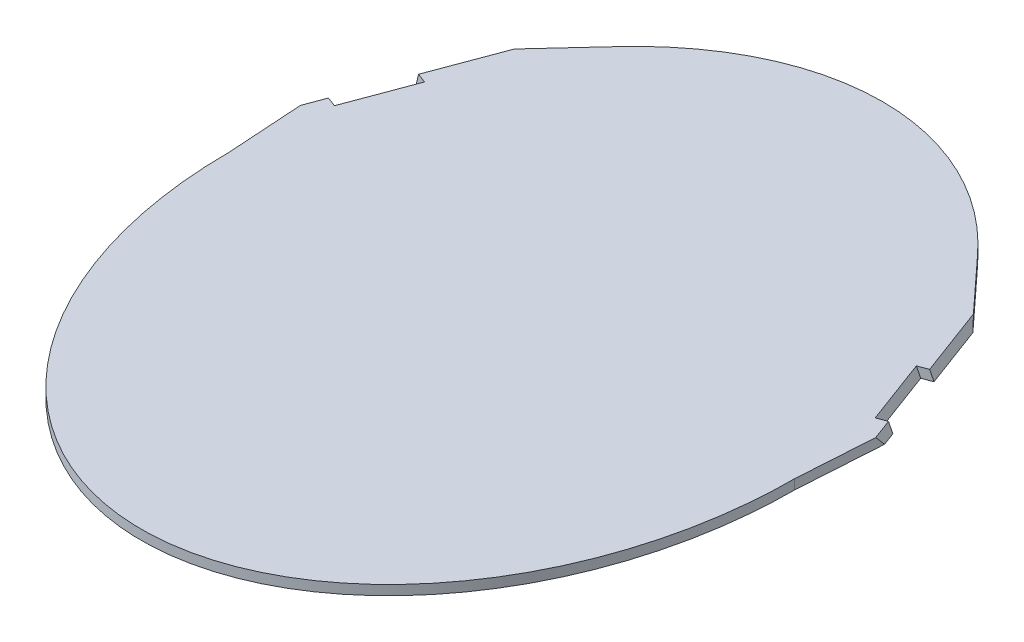
ISO-10303-21;
HEADER;
FILE_DESCRIPTION(('STEP AP214'),'2;1');
FILE_NAME('part.step','',(''),(''),'','','');
FILE_SCHEMA(('AUTOMOTIVE_DESIGN { 1 0 10303 214 1 1 1 1 }'));
ENDSEC;
DATA;
#1=APPLICATION_CONTEXT('core data for automotive mechanical design processes');
#2=APPLICATION_PROTOCOL_DEFINITION('international standard','automotive_design',2000,#1);
#3=PRODUCT_CONTEXT('',#1,'mechanical');
#4=PRODUCT('Part','Part','',(#3));
#5=PRODUCT_RELATED_PRODUCT_CATEGORY('part','',(#4));
#6=PRODUCT_DEFINITION_FORMATION('','',#4);
#7=PRODUCT_DEFINITION_CONTEXT('part definition',#1,'design');
#8=PRODUCT_DEFINITION('design','',#6,#7);
#9=PRODUCT_DEFINITION_SHAPE('','',#8);
#10=(LENGTH_UNIT() NAMED_UNIT(*) SI_UNIT(.MILLI.,.METRE.));
#11=(NAMED_UNIT(*) PLANE_ANGLE_UNIT() SI_UNIT($,.RADIAN.));
#12=(NAMED_UNIT(*) SI_UNIT($,.STERADIAN.) SOLID_ANGLE_UNIT());
#13=UNCERTAINTY_MEASURE_WITH_UNIT(LENGTH_MEASURE(1.E-05),#10,'distance_accuracy_value','');
#14=(GEOMETRIC_REPRESENTATION_CONTEXT(3) GLOBAL_UNCERTAINTY_ASSIGNED_CONTEXT((#13)) GLOBAL_UNIT_ASSIGNED_CONTEXT((#10,
#11,#12)) REPRESENTATION_CONTEXT('',''));
#15=CARTESIAN_POINT('',(0.,0.,0.));
#16=DIRECTION('',(0.,0.,1.));
#17=DIRECTION('',(1.,0.,0.));
#18=AXIS2_PLACEMENT_3D('',#15,#16,#17);
#19=CARTESIAN_POINT('',(0.,10.,0.));
#20=DIRECTION('',(0.,1.,0.));
#21=DIRECTION('',(0.,0.,1.));
#22=AXIS2_PLACEMENT_3D('',#19,#20,#21);
#23=PLANE('',#22);
#24=DIRECTION('',(-0.677985688036719,0.,0.735075102841456));
#25=VECTOR('',#24,1.);
#26=CARTESIAN_POINT('',(-244.797124662854,10.,-227.718261487219));
#27=LINE('',#26,#25);
#28=CARTESIAN_POINT('',(-188.989530621691,10.,-288.225103523861));
#29=VERTEX_POINT('',#28);
#30=CARTESIAN_POINT('',(-235.398823471506,10.,-237.907941500628));
#31=VERTEX_POINT('',#30);
#32=EDGE_CURVE('E179',#29,#31,#27,.T.);
#33=ORIENTED_EDGE('',*,*,#32,.T.);
#34=DIRECTION('',(-0.349563318607243,0.,0.936912742086632));
#35=VECTOR('',#34,1.);
#36=CARTESIAN_POINT('',(-284.551686512762,10.,-106.166590958256));
#37=LINE('',#36,#35);
#38=CARTESIAN_POINT('',(-262.120047496992,10.,-166.288712762963));
#39=VERTEX_POINT('',#38);
#40=EDGE_CURVE('E58',#31,#39,#37,.T.);
#41=ORIENTED_EDGE('',*,*,#40,.T.);
#42=DIRECTION('',(0.93691274208663,0.,0.349563318607247));
#43=VECTOR('',#42,1.);
#44=CARTESIAN_POINT('',(-262.120047496992,10.,-166.288712762963));
#45=LINE('',#44,#43);
#46=CARTESIAN_POINT('',(-252.194985780218,10.,-162.585659794155));
#47=VERTEX_POINT('',#46);
#48=EDGE_CURVE('E183',#39,#47,#45,.T.);
#49=ORIENTED_EDGE('',*,*,#48,.T.);
#50=DIRECTION('',(0.349563318607244,0.,-0.936912742086631));
#51=VECTOR('',#50,1.);
#52=CARTESIAN_POINT('',(-274.626624795988,10.,-102.463537989448));
#53=LINE('',#52,#51);
#54=CARTESIAN_POINT('',(-277.302971101002,10.,-95.290294053572));
#55=VERTEX_POINT('',#54);
#56=EDGE_CURVE('E314',#55,#47,#53,.T.);
#57=ORIENTED_EDGE('',*,*,#56,.F.);
#58=DIRECTION('',(-0.936912742086631,0.,-0.349563318607244));
#59=VECTOR('',#58,1.);
#60=CARTESIAN_POINT('',(-287.228032817776,10.,-98.9933470223794));
#61=LINE('',#60,#59);
#62=CARTESIAN_POINT('',(-287.228032817776,10.,-98.9933470223794));
#63=VERTEX_POINT('',#62);
#64=EDGE_CURVE('E191',#55,#63,#61,.T.);
#65=ORIENTED_EDGE('',*,*,#64,.T.);
#66=CARTESIAN_POINT('',(-295.026682691708,10.,-78.0911125800736));
#67=VERTEX_POINT('',#66);
#68=EDGE_CURVE('E282',#63,#67,#37,.T.);
#69=ORIENTED_EDGE('',*,*,#68,.T.);
#70=DIRECTION('',(0.0642365171820704,0.,0.997934702202663));
#71=VECTOR('',#70,1.);
#72=CARTESIAN_POINT('',(-296.597160238643,10.,-102.488980208452));
#73=LINE('',#72,#71);
#74=CARTESIAN_POINT('',(-290.,10.,0.));
#75=VERTEX_POINT('',#74);
#76=EDGE_CURVE('E177',#67,#75,#73,.T.);
#77=ORIENTED_EDGE('',*,*,#76,.T.);
#78=CARTESIAN_POINT('',(0.,10.,0.));
#79=DIRECTION('',(0.,1.,0.));
#80=DIRECTION('',(0.,0.,-1.));
#81=AXIS2_PLACEMENT_3D('',#78,#79,#80);
#82=ELLIPSE('',#81,380.,290.);
#83=CARTESIAN_POINT('',(290.,10.,2.4769174145734E-13));
#84=VERTEX_POINT('',#83);
#85=EDGE_CURVE('E231',#75,#84,#82,.T.);
#86=ORIENTED_EDGE('',*,*,#85,.T.);
#87=DIRECTION('',(0.0642365171820704,0.,-0.997934702202663));
#88=VECTOR('',#87,1.);
#89=CARTESIAN_POINT('',(296.597160238643,10.,-102.488980208452));
#90=LINE('',#89,#88);
#91=CARTESIAN_POINT('',(295.026682691708,10.,-78.0911125800736));
#92=VERTEX_POINT('',#91);
#93=EDGE_CURVE('E219',#84,#92,#90,.T.);
#94=ORIENTED_EDGE('',*,*,#93,.T.);
#95=DIRECTION('',(-0.349563318607243,0.,-0.936912742086632));
#96=VECTOR('',#95,1.);
#97=CARTESIAN_POINT('',(284.551686512762,10.,-106.166590958256));
#98=LINE('',#97,#96);
#99=CARTESIAN_POINT('',(287.228032817776,10.,-98.9933470223794));
#100=VERTEX_POINT('',#99);
#101=EDGE_CURVE('E267',#92,#100,#98,.T.);
#102=ORIENTED_EDGE('',*,*,#101,.T.);
#103=DIRECTION('',(-0.936912742086631,0.,0.349563318607244));
#104=VECTOR('',#103,1.);
#105=CARTESIAN_POINT('',(287.228032817776,10.,-98.9933470223794));
#106=LINE('',#105,#104);
#107=CARTESIAN_POINT('',(277.302971101002,10.,-95.290294053572));
#108=VERTEX_POINT('',#107);
#109=EDGE_CURVE('E215',#100,#108,#106,.T.);
#110=ORIENTED_EDGE('',*,*,#109,.T.);
#111=DIRECTION('',(0.349563318607244,0.,0.936912742086631));
#112=VECTOR('',#111,1.);
#113=CARTESIAN_POINT('',(274.626624795988,10.,-102.463537989448));
#114=LINE('',#113,#112);
#115=CARTESIAN_POINT('',(252.194985780218,10.,-162.585659794155));
#116=VERTEX_POINT('',#115);
#117=EDGE_CURVE('E185',#116,#108,#114,.T.);
#118=ORIENTED_EDGE('',*,*,#117,.F.);
#119=DIRECTION('',(0.936912742086631,0.,-0.349563318607243));
#120=VECTOR('',#119,1.);
#121=CARTESIAN_POINT('',(262.120047496992,10.,-166.288712762963));
#122=LINE('',#121,#120);
#123=CARTESIAN_POINT('',(262.120047496992,10.,-166.288712762963));
#124=VERTEX_POINT('',#123);
#125=EDGE_CURVE('E206',#116,#124,#122,.T.);
#126=ORIENTED_EDGE('',*,*,#125,.T.);
#127=CARTESIAN_POINT('',(235.398823471506,10.,-237.907941500628));
#128=VERTEX_POINT('',#127);
#129=EDGE_CURVE('E274',#124,#128,#98,.T.);
#130=ORIENTED_EDGE('',*,*,#129,.T.);
#131=DIRECTION('',(-0.677985688036719,0.,-0.735075102841456));
#132=VECTOR('',#131,1.);
#133=CARTESIAN_POINT('',(244.797124662854,10.,-227.718261487219));
#134=LINE('',#133,#132);
#135=CARTESIAN_POINT('',(188.989530621691,10.,-288.225103523861));
#136=VERTEX_POINT('',#135);
#137=EDGE_CURVE('E202',#128,#136,#134,.T.);
#138=ORIENTED_EDGE('',*,*,#137,.T.);
#139=EDGE_CURVE('E234',#136,#29,#82,.T.);
#140=ORIENTED_EDGE('',*,*,#139,.T.);
#141=EDGE_LOOP('',(#33,#41,#49,#57,#65,#69,#77,#86,#94,#102,#110,#118,#126,#130,#138,#140));
#142=FACE_BOUND('',#141,.T.);
#143=ADVANCED_FACE('F33',(#142),#23,.T.);
#144=CARTESIAN_POINT('',(0.,0.,0.));
#145=DIRECTION('',(0.,1.,0.));
#146=DIRECTION('',(0.,0.,1.));
#147=AXIS2_PLACEMENT_3D('',#144,#145,#146);
#148=PLANE('',#147);
#149=DIRECTION('',(-0.349563318607243,0.,0.936912742086632));
#150=VECTOR('',#149,1.);
#151=CARTESIAN_POINT('',(-287.826789786454,0.,-107.388536095413));
#152=LINE('',#151,#150);
#153=CARTESIAN_POINT('',(-241.664357599071,0.,-231.114821491688));
#154=VERTEX_POINT('',#153);
#155=CARTESIAN_POINT('',(-265.395150770684,0.,-167.51065790012));
#156=VERTEX_POINT('',#155);
#157=EDGE_CURVE('E158',#154,#156,#152,.T.);
#158=ORIENTED_EDGE('',*,*,#157,.F.);
#159=DIRECTION('',(-0.677985688036719,0.,0.735075102841456));
#160=VECTOR('',#159,1.);
#161=CARTESIAN_POINT('',(-244.797124662854,0.,-227.718261487219));
#162=LINE('',#161,#160);
#163=CARTESIAN_POINT('',(-188.989530621691,0.,-288.225103523861));
#164=VERTEX_POINT('',#163);
#165=EDGE_CURVE('E168',#164,#154,#162,.T.);
#166=ORIENTED_EDGE('',*,*,#165,.F.);
#167=CARTESIAN_POINT('',(0.,0.,0.));
#168=DIRECTION('',(0.,1.,0.));
#169=DIRECTION('',(0.,0.,-1.));
#170=AXIS2_PLACEMENT_3D('',#167,#168,#169);
#171=ELLIPSE('',#170,380.,290.);
#172=CARTESIAN_POINT('',(188.989530621691,0.,-288.225103523861));
#173=VERTEX_POINT('',#172);
#174=EDGE_CURVE('E237',#173,#164,#171,.T.);
#175=ORIENTED_EDGE('',*,*,#174,.F.);
#176=DIRECTION('',(-0.677985688036719,0.,-0.735075102841456));
#177=VECTOR('',#176,1.);
#178=CARTESIAN_POINT('',(244.797124662854,0.,-227.718261487219));
#179=LINE('',#178,#177);
#180=CARTESIAN_POINT('',(241.664357599071,0.,-231.114821491688));
#181=VERTEX_POINT('',#180);
#182=EDGE_CURVE('E203',#181,#173,#179,.T.);
#183=ORIENTED_EDGE('',*,*,#182,.F.);
#184=DIRECTION('',(-0.349563318607243,0.,-0.936912742086632));
#185=VECTOR('',#184,1.);
#186=CARTESIAN_POINT('',(287.826789786454,0.,-107.388536095413));
#187=LINE('',#186,#185);
#188=CARTESIAN_POINT('',(265.395150770684,0.,-167.51065790012));
#189=VERTEX_POINT('',#188);
#190=EDGE_CURVE('E270',#189,#181,#187,.T.);
#191=ORIENTED_EDGE('',*,*,#190,.F.);
#192=DIRECTION('',(0.93691274208663,0.,-0.349563318607247));
#193=VECTOR('',#192,1.);
#194=CARTESIAN_POINT('',(262.120047496992,0.,-166.288712762963));
#195=LINE('',#194,#193);
#196=CARTESIAN_POINT('',(255.47008905391,0.,-163.807604931312));
#197=VERTEX_POINT('',#196);
#198=EDGE_CURVE('E205',#197,#189,#195,.T.);
#199=ORIENTED_EDGE('',*,*,#198,.F.);
#200=DIRECTION('',(0.349563318607244,0.,0.936912742086631));
#201=VECTOR('',#200,1.);
#202=CARTESIAN_POINT('',(277.90172806968,0.,-103.685483126605));
#203=LINE('',#202,#201);
#204=CARTESIAN_POINT('',(280.388867724071,0.,-97.0193579655542));
#205=VERTEX_POINT('',#204);
#206=EDGE_CURVE('E336',#197,#205,#203,.T.);
#207=ORIENTED_EDGE('',*,*,#206,.T.);
#208=CARTESIAN_POINT('',(280.496850606306,0.,-96.4819345009197));
#209=VERTEX_POINT('',#208);
#210=EDGE_CURVE('E235',#209,#205,#171,.T.);
#211=ORIENTED_EDGE('',*,*,#210,.F.);
#212=DIRECTION('',(-0.936912742086631,0.,0.349563318607244));
#213=VECTOR('',#212,1.);
#214=CARTESIAN_POINT('',(287.228032817776,0.,-98.9933470223794));
#215=LINE('',#214,#213);
#216=CARTESIAN_POINT('',(290.503136091468,0.,-100.215292159536));
#217=VERTEX_POINT('',#216);
#218=EDGE_CURVE('E216',#217,#209,#215,.T.);
#219=ORIENTED_EDGE('',*,*,#218,.F.);
#220=CARTESIAN_POINT('',(295.575664034813,0.,-86.6197121551897));
#221=VERTEX_POINT('',#220);
#222=EDGE_CURVE('E263',#221,#217,#187,.T.);
#223=ORIENTED_EDGE('',*,*,#222,.F.);
#224=DIRECTION('',(0.0642365171820704,0.,-0.997934702202663));
#225=VECTOR('',#224,1.);
#226=CARTESIAN_POINT('',(296.597160238643,0.,-102.488980208452));
#227=LINE('',#226,#225);
#228=CARTESIAN_POINT('',(290.,0.,2.4769174145734E-13));
#229=VERTEX_POINT('',#228);
#230=EDGE_CURVE('E218',#229,#221,#227,.T.);
#231=ORIENTED_EDGE('',*,*,#230,.F.);
#232=CARTESIAN_POINT('',(-290.,0.,2.4769174145734E-13));
#233=VERTEX_POINT('',#232);
#234=EDGE_CURVE('E230',#233,#229,#171,.T.);
#235=ORIENTED_EDGE('',*,*,#234,.F.);
#236=DIRECTION('',(0.0642365171820704,0.,0.997934702202663));
#237=VECTOR('',#236,1.);
#238=CARTESIAN_POINT('',(-296.597160238643,0.,-102.488980208452));
#239=LINE('',#238,#237);
#240=CARTESIAN_POINT('',(-295.575664034813,0.,-86.6197121551897));
#241=VERTEX_POINT('',#240);
#242=EDGE_CURVE('E190',#241,#233,#239,.T.);
#243=ORIENTED_EDGE('',*,*,#242,.F.);
#244=CARTESIAN_POINT('',(-290.503136091468,0.,-100.215292159536));
#245=VERTEX_POINT('',#244);
#246=EDGE_CURVE('E50',#245,#241,#152,.T.);
#247=ORIENTED_EDGE('',*,*,#246,.F.);
#248=DIRECTION('',(-0.936912742086631,0.,-0.349563318607244));
#249=VECTOR('',#248,1.);
#250=CARTESIAN_POINT('',(-287.228032817776,0.,-98.9933470223794));
#251=LINE('',#250,#249);
#252=CARTESIAN_POINT('',(-280.496850606306,0.,-96.4819345009197));
#253=VERTEX_POINT('',#252);
#254=EDGE_CURVE('E187',#253,#245,#251,.T.);
#255=ORIENTED_EDGE('',*,*,#254,.F.);
#256=CARTESIAN_POINT('',(-280.388867724071,0.,-97.0193579655542));
#257=VERTEX_POINT('',#256);
#258=EDGE_CURVE('E238',#257,#253,#171,.T.);
#259=ORIENTED_EDGE('',*,*,#258,.F.);
#260=DIRECTION('',(0.349563318607244,0.,-0.936912742086631));
#261=VECTOR('',#260,1.);
#262=CARTESIAN_POINT('',(-277.90172806968,0.,-103.685483126605));
#263=LINE('',#262,#261);
#264=CARTESIAN_POINT('',(-255.47008905391,0.,-163.807604931312));
#265=VERTEX_POINT('',#264);
#266=EDGE_CURVE('E299',#257,#265,#263,.T.);
#267=ORIENTED_EDGE('',*,*,#266,.T.);
#268=DIRECTION('',(0.936912742086631,0.,0.349563318607243));
#269=VECTOR('',#268,1.);
#270=CARTESIAN_POINT('',(-262.120047496992,0.,-166.288712762963));
#271=LINE('',#270,#269);
#272=EDGE_CURVE('E171',#156,#265,#271,.T.);
#273=ORIENTED_EDGE('',*,*,#272,.F.);
#274=EDGE_LOOP('',(#158,#166,#175,#183,#191,#199,#207,#211,#219,#223,#231,#235,#243,#247,#255,
#259,#267,#273));
#275=FACE_BOUND('',#274,.T.);
#276=ADVANCED_FACE('F166',(#275),#148,.F.);
#277=CARTESIAN_POINT('',(-287.228032817776,0.,-98.9933470223794));
#278=DIRECTION('',(0.349563318607244,0.,-0.936912742086631));
#279=DIRECTION('',(-0.936912742086631,0.,-0.349563318607244));
#280=AXIS2_PLACEMENT_3D('',#277,#278,#279);
#281=PLANE('',#280);
#282=ORIENTED_EDGE('',*,*,#254,.T.);
#283=DIRECTION('',(0.309165431544454,0.943986817233752,0.11535001008592));
#284=VECTOR('',#283,1.);
#285=CARTESIAN_POINT('',(-290.146513735,1.08888888888885,-100.082235911268));
#286=LINE('',#285,#284);
#287=EDGE_CURVE('E278',#245,#63,#286,.T.);
#288=ORIENTED_EDGE('',*,*,#287,.T.);
#289=ORIENTED_EDGE('',*,*,#64,.F.);
#290=DIRECTION('',(-0.309165431544454,-0.943986817233752,-0.115350010085923));
#291=VECTOR('',#290,1.);
#292=CARTESIAN_POINT('',(-281.302180960719,-2.2109427566487,-96.7824042657311));
#293=LINE('',#292,#291);
#294=CARTESIAN_POINT('',(-280.496850606306,0.248003685991113,-96.4819345009197));
#295=VERTEX_POINT('',#294);
#296=EDGE_CURVE('E300',#55,#295,#293,.T.);
#297=ORIENTED_EDGE('',*,*,#296,.T.);
#298=DIRECTION('',(0.,-1.,0.));
#299=VECTOR('',#298,1.);
#300=CARTESIAN_POINT('',(-280.496850606306,10.,-96.4819345009197));
#301=LINE('',#300,#299);
#302=EDGE_CURVE('E199',#253,#295,#301,.F.);
#303=ORIENTED_EDGE('',*,*,#302,.F.);
#304=EDGE_LOOP('',(#282,#288,#289,#297,#303));
#305=FACE_BOUND('',#304,.T.);
#306=ADVANCED_FACE('F353',(#305),#281,.T.);
#307=CARTESIAN_POINT('',(-296.597160238643,0.,-102.488980208452));
#308=DIRECTION('',(-0.997934702202663,0.,0.0642365171820704));
#309=DIRECTION('',(0.0642365171820704,0.,0.997934702202663));
#310=AXIS2_PLACEMENT_3D('',#307,#308,#309);
#311=PLANE('',#310);
#312=ORIENTED_EDGE('',*,*,#76,.F.);
#313=DIRECTION('',(-0.0417336482239318,-0.760201576030195,-0.648345483833372));
#314=VECTOR('',#313,1.);
#315=CARTESIAN_POINT('',(-296.006831007897,-7.8539458307572,-93.3180280627078));
#316=LINE('',#315,#314);
#317=EDGE_CURVE('E287',#67,#241,#316,.T.);
#318=ORIENTED_EDGE('',*,*,#317,.T.);
#319=ORIENTED_EDGE('',*,*,#242,.T.);
#320=DIRECTION('',(0.,1.,0.));
#321=VECTOR('',#320,1.);
#322=CARTESIAN_POINT('',(-290.,0.,2.4769174145734E-13));
#323=LINE('',#322,#321);
#324=EDGE_CURVE('E193',#233,#75,#323,.T.);
#325=ORIENTED_EDGE('',*,*,#324,.T.);
#326=EDGE_LOOP('',(#312,#318,#319,#325));
#327=FACE_BOUND('',#326,.T.);
#328=ADVANCED_FACE('F360',(#327),#311,.T.);
#329=CARTESIAN_POINT('',(-262.120047496992,0.,-166.288712762963));
#330=DIRECTION('',(-0.349563318607247,0.,0.93691274208663));
#331=DIRECTION('',(0.93691274208663,0.,0.349563318607247));
#332=AXIS2_PLACEMENT_3D('',#329,#330,#331);
#333=PLANE('',#332);
#334=ORIENTED_EDGE('',*,*,#48,.F.);
#335=DIRECTION('',(-0.309165431544453,-0.943986817233752,-0.115350010085921));
#336=VECTOR('',#335,1.);
#337=CARTESIAN_POINT('',(-265.038528414216,1.08888888888884,-167.377601651852));
#338=LINE('',#337,#336);
#339=EDGE_CURVE('E289',#39,#156,#338,.T.);
#340=ORIENTED_EDGE('',*,*,#339,.T.);
#341=ORIENTED_EDGE('',*,*,#272,.T.);
#342=DIRECTION('',(0.309165431544453,0.943986817233752,0.115350010085924));
#343=VECTOR('',#342,1.);
#344=CARTESIAN_POINT('',(-246.896185956159,26.179031258715,-160.608670937105));
#345=LINE('',#344,#343);
#346=EDGE_CURVE('E297',#265,#47,#345,.T.);
#347=ORIENTED_EDGE('',*,*,#346,.T.);
#348=EDGE_LOOP('',(#334,#340,#341,#347));
#349=FACE_BOUND('',#348,.T.);
#350=ADVANCED_FACE('F295',(#349),#333,.T.);
#351=CARTESIAN_POINT('',(-244.797124662854,0.,-227.718261487219));
#352=DIRECTION('',(-0.735075102841456,0.,-0.677985688036719));
#353=DIRECTION('',(-0.677985688036719,0.,0.735075102841456));
#354=AXIS2_PLACEMENT_3D('',#351,#352,#353);
#355=PLANE('',#354);
#356=ORIENTED_EDGE('',*,*,#165,.T.);
#357=DIRECTION('',(0.460149819383471,0.734414353213777,-0.498896483766872));
#358=VECTOR('',#357,1.);
#359=CARTESIAN_POINT('',(-243.107421502934,-2.30317778896802,-229.55024517945));
#360=LINE('',#359,#358);
#361=EDGE_CURVE('E11',#154,#31,#360,.T.);
#362=ORIENTED_EDGE('',*,*,#361,.T.);
#363=ORIENTED_EDGE('',*,*,#32,.F.);
#364=DIRECTION('',(0.,1.,0.));
#365=VECTOR('',#364,1.);
#366=CARTESIAN_POINT('',(-188.989530621691,0.,-288.225103523861));
#367=LINE('',#366,#365);
#368=EDGE_CURVE('E175',#164,#29,#367,.T.);
#369=ORIENTED_EDGE('',*,*,#368,.F.);
#370=EDGE_LOOP('',(#356,#362,#363,#369));
#371=FACE_BOUND('',#370,.T.);
#372=ADVANCED_FACE('F173',(#371),#355,.T.);
#373=CARTESIAN_POINT('',(287.228032817776,0.,-98.9933470223794));
#374=DIRECTION('',(-0.349563318607244,0.,-0.936912742086631));
#375=DIRECTION('',(-0.936912742086631,0.,0.349563318607244));
#376=AXIS2_PLACEMENT_3D('',#373,#374,#375);
#377=PLANE('',#376);
#378=ORIENTED_EDGE('',*,*,#109,.F.);
#379=DIRECTION('',(0.309165431544454,-0.943986817233752,-0.11535001008592));
#380=VECTOR('',#379,1.);
#381=CARTESIAN_POINT('',(290.146513735,1.08888888888885,-100.082235911268));
#382=LINE('',#381,#380);
#383=EDGE_CURVE('E272',#100,#217,#382,.T.);
#384=ORIENTED_EDGE('',*,*,#383,.T.);
#385=ORIENTED_EDGE('',*,*,#218,.T.);
#386=DIRECTION('',(0.,-1.,0.));
#387=VECTOR('',#386,1.);
#388=CARTESIAN_POINT('',(280.496850606306,10.,-96.4819345009197));
#389=LINE('',#388,#387);
#390=CARTESIAN_POINT('',(280.496850606306,0.248003685991113,-96.4819345009197));
#391=VERTEX_POINT('',#390);
#392=EDGE_CURVE('E228',#391,#209,#389,.T.);
#393=ORIENTED_EDGE('',*,*,#392,.F.);
#394=DIRECTION('',(0.309165431544454,-0.943986817233752,-0.115350010085923));
#395=VECTOR('',#394,1.);
#396=CARTESIAN_POINT('',(281.302180960719,-2.2109427566487,-96.7824042657311));
#397=LINE('',#396,#395);
#398=EDGE_CURVE('E342',#108,#391,#397,.T.);
#399=ORIENTED_EDGE('',*,*,#398,.F.);
#400=EDGE_LOOP('',(#378,#384,#385,#393,#399));
#401=FACE_BOUND('',#400,.T.);
#402=ADVANCED_FACE('F349',(#401),#377,.T.);
#403=CARTESIAN_POINT('',(296.597160238643,0.,-102.488980208452));
#404=DIRECTION('',(0.997934702202663,0.,0.0642365171820704));
#405=DIRECTION('',(0.0642365171820704,0.,-0.997934702202663));
#406=AXIS2_PLACEMENT_3D('',#403,#404,#405);
#407=PLANE('',#406);
#408=ORIENTED_EDGE('',*,*,#230,.T.);
#409=DIRECTION('',(-0.0417336482239318,0.760201576030195,0.648345483833372));
#410=VECTOR('',#409,1.);
#411=CARTESIAN_POINT('',(296.006831007897,-7.8539458307572,-93.3180280627078));
#412=LINE('',#411,#410);
#413=EDGE_CURVE('E268',#221,#92,#412,.T.);
#414=ORIENTED_EDGE('',*,*,#413,.T.);
#415=ORIENTED_EDGE('',*,*,#93,.F.);
#416=DIRECTION('',(0.,1.,0.));
#417=VECTOR('',#416,1.);
#418=CARTESIAN_POINT('',(290.,0.,2.4769174145734E-13));
#419=LINE('',#418,#417);
#420=EDGE_CURVE('E222',#229,#84,#419,.T.);
#421=ORIENTED_EDGE('',*,*,#420,.F.);
#422=EDGE_LOOP('',(#408,#414,#415,#421));
#423=FACE_BOUND('',#422,.T.);
#424=ADVANCED_FACE('F259',(#423),#407,.T.);
#425=CARTESIAN_POINT('',(262.120047496992,0.,-166.288712762963));
#426=DIRECTION('',(0.349563318607243,0.,0.936912742086632));
#427=DIRECTION('',(0.936912742086632,0.,-0.349563318607243));
#428=AXIS2_PLACEMENT_3D('',#425,#426,#427);
#429=PLANE('',#428);
#430=ORIENTED_EDGE('',*,*,#198,.T.);
#431=DIRECTION('',(-0.309165431544454,0.943986817233752,0.11535001008592));
#432=VECTOR('',#431,1.);
#433=CARTESIAN_POINT('',(265.038528414216,1.08888888888884,-167.377601651852));
#434=LINE('',#433,#432);
#435=EDGE_CURVE('E275',#189,#124,#434,.T.);
#436=ORIENTED_EDGE('',*,*,#435,.T.);
#437=ORIENTED_EDGE('',*,*,#125,.F.);
#438=DIRECTION('',(-0.309165431544455,0.943986817233751,0.115350010085923));
#439=VECTOR('',#438,1.);
#440=CARTESIAN_POINT('',(253.145519393204,7.09769880961953,-162.94030507677));
#441=LINE('',#440,#439);
#442=EDGE_CURVE('E345',#197,#116,#441,.T.);
#443=ORIENTED_EDGE('',*,*,#442,.F.);
#444=EDGE_LOOP('',(#430,#436,#437,#443));
#445=FACE_BOUND('',#444,.T.);
#446=ADVANCED_FACE('F378',(#445),#429,.T.);
#447=CARTESIAN_POINT('',(244.797124662854,0.,-227.718261487219));
#448=DIRECTION('',(0.735075102841456,0.,-0.677985688036719));
#449=DIRECTION('',(-0.677985688036719,0.,-0.735075102841456));
#450=AXIS2_PLACEMENT_3D('',#447,#448,#449);
#451=PLANE('',#450);
#452=ORIENTED_EDGE('',*,*,#137,.F.);
#453=DIRECTION('',(0.460149819383471,-0.734414353213777,0.498896483766872));
#454=VECTOR('',#453,1.);
#455=CARTESIAN_POINT('',(243.107421502934,-2.30317778896802,-229.55024517945));
#456=LINE('',#455,#454);
#457=EDGE_CURVE('E43',#128,#181,#456,.T.);
#458=ORIENTED_EDGE('',*,*,#457,.T.);
#459=ORIENTED_EDGE('',*,*,#182,.T.);
#460=DIRECTION('',(0.,1.,0.));
#461=VECTOR('',#460,1.);
#462=CARTESIAN_POINT('',(188.989530621691,0.,-288.225103523861));
#463=LINE('',#462,#461);
#464=EDGE_CURVE('E209',#173,#136,#463,.T.);
#465=ORIENTED_EDGE('',*,*,#464,.T.);
#466=EDGE_LOOP('',(#452,#458,#459,#465));
#467=FACE_BOUND('',#466,.T.);
#468=ADVANCED_FACE('F379',(#467),#451,.T.);
#469=DIRECTION('',(0.,-1.,0.));
#470=VECTOR('',#469,1.);
#471=SURFACE_OF_LINEAR_EXTRUSION('',#82,#470);
#472=ORIENTED_EDGE('',*,*,#174,.T.);
#473=ORIENTED_EDGE('',*,*,#368,.T.);
#474=ORIENTED_EDGE('',*,*,#139,.F.);
#475=ORIENTED_EDGE('',*,*,#464,.F.);
#476=EDGE_LOOP('',(#472,#473,#474,#475));
#477=FACE_BOUND('',#476,.T.);
#478=ADVANCED_FACE('F249',(#477),#471,.F.);
#479=ORIENTED_EDGE('',*,*,#302,.T.);
#480=CARTESIAN_POINT('',(-280.496850606306,0.248003685991583,-96.4819345009197));
#481=CARTESIAN_POINT('',(-280.478915785255,0.20654686773471,-96.5714609004965));
#482=CARTESIAN_POINT('',(-280.460949801209,0.165151484773635,-96.6610093890045));
#483=CARTESIAN_POINT('',(-280.424955507131,0.0824835894430816,-96.8401505438828));
#484=CARTESIAN_POINT('',(-280.406927197098,0.0412110770736026,-96.9297432102532));
#485=CARTESIAN_POINT('',(-280.388867724071,0.,-97.0193579655547));
#486=B_SPLINE_CURVE_WITH_KNOTS('',3,(#480,#481,#482,#483,#484,#485),.UNSPECIFIED.,.F.,.F.,(4,2,
4),(0.,0.300828148559123,0.601656297118257),.UNSPECIFIED.);
#487=EDGE_CURVE('E302',#295,#257,#486,.T.);
#488=ORIENTED_EDGE('',*,*,#487,.T.);
#489=ORIENTED_EDGE('',*,*,#258,.T.);
#490=EDGE_LOOP('',(#479,#488,#489));
#491=FACE_BOUND('',#490,.T.);
#492=ADVANCED_FACE('F357',(#491),#471,.F.);
#493=ORIENTED_EDGE('',*,*,#210,.T.);
#494=CARTESIAN_POINT('',(280.388867724071,0.,-97.0193579655547));
#495=CARTESIAN_POINT('',(280.406927197098,0.0412110770736341,-96.9297432102532));
#496=CARTESIAN_POINT('',(280.424955507131,0.0824835894430673,-96.8401505438829));
#497=CARTESIAN_POINT('',(280.460949801209,0.165151484773531,-96.6610093890046));
#498=CARTESIAN_POINT('',(280.478915785255,0.206546867734561,-96.5714609004966));
#499=CARTESIAN_POINT('',(280.496850606306,0.248003685991391,-96.4819345009198));
#500=B_SPLINE_CURVE_WITH_KNOTS('',3,(#494,#495,#496,#497,#498,#499),.UNSPECIFIED.,.F.,.F.,(4,2,
4),(0.,0.300828148559027,0.601656297118046),.UNSPECIFIED.);
#501=EDGE_CURVE('E330',#205,#391,#500,.T.);
#502=ORIENTED_EDGE('',*,*,#501,.T.);
#503=ORIENTED_EDGE('',*,*,#392,.T.);
#504=EDGE_LOOP('',(#493,#502,#503));
#505=FACE_BOUND('',#504,.T.);
#506=ADVANCED_FACE('F529',(#505),#471,.F.);
#507=ORIENTED_EDGE('',*,*,#85,.F.);
#508=ORIENTED_EDGE('',*,*,#324,.F.);
#509=ORIENTED_EDGE('',*,*,#234,.T.);
#510=ORIENTED_EDGE('',*,*,#420,.T.);
#511=EDGE_LOOP('',(#507,#508,#509,#510));
#512=FACE_BOUND('',#511,.T.);
#513=ADVANCED_FACE('F35',(#512),#471,.F.);
#514=CARTESIAN_POINT('',(281.302180960719,-2.2109427566487,-96.7824042657311));
#515=DIRECTION('',(-0.884433277428106,-0.329983164553725,0.32998316455372));
#516=DIRECTION('',(0.349563318607249,-0.93691274208663,0.));
#517=AXIS2_PLACEMENT_3D('',#514,#515,#516);
#518=PLANE('',#517);
#519=ORIENTED_EDGE('',*,*,#117,.T.);
#520=ORIENTED_EDGE('',*,*,#398,.T.);
#521=ORIENTED_EDGE('',*,*,#501,.F.);
#522=ORIENTED_EDGE('',*,*,#206,.F.);
#523=ORIENTED_EDGE('',*,*,#442,.T.);
#524=EDGE_LOOP('',(#519,#520,#521,#522,#523));
#525=FACE_BOUND('',#524,.T.);
#526=ADVANCED_FACE('F322',(#525),#518,.F.);
#527=CARTESIAN_POINT('',(-281.302180960719,-2.2109427566487,-96.7824042657311));
#528=DIRECTION('',(0.884433277428106,-0.329983164553725,0.32998316455372));
#529=DIRECTION('',(-0.349563318607249,-0.93691274208663,0.));
#530=AXIS2_PLACEMENT_3D('',#527,#528,#529);
#531=PLANE('',#530);
#532=ORIENTED_EDGE('',*,*,#56,.T.);
#533=ORIENTED_EDGE('',*,*,#346,.F.);
#534=ORIENTED_EDGE('',*,*,#266,.F.);
#535=ORIENTED_EDGE('',*,*,#487,.F.);
#536=ORIENTED_EDGE('',*,*,#296,.F.);
#537=EDGE_LOOP('',(#532,#533,#534,#535,#536));
#538=FACE_BOUND('',#537,.T.);
#539=ADVANCED_FACE('F316',(#538),#531,.F.);
#540=CARTESIAN_POINT('',(376.453514744666,-115.115137927258,15.0370045404907));
#541=DIRECTION('',(0.884433277428107,0.329983164553724,-0.32998316455372));
#542=DIRECTION('',(-0.349563318607248,0.93691274208663,0.));
#543=AXIS2_PLACEMENT_3D('',#540,#541,#542);
#544=PLANE('',#543);
#545=ORIENTED_EDGE('',*,*,#190,.T.);
#546=ORIENTED_EDGE('',*,*,#457,.F.);
#547=ORIENTED_EDGE('',*,*,#129,.F.);
#548=ORIENTED_EDGE('',*,*,#435,.F.);
#549=EDGE_LOOP('',(#545,#546,#547,#548));
#550=FACE_BOUND('',#549,.T.);
#551=ADVANCED_FACE('F321',(#550),#544,.T.);
#552=ORIENTED_EDGE('',*,*,#101,.F.);
#553=ORIENTED_EDGE('',*,*,#413,.F.);
#554=ORIENTED_EDGE('',*,*,#222,.T.);
#555=ORIENTED_EDGE('',*,*,#383,.F.);
#556=EDGE_LOOP('',(#552,#553,#554,#555));
#557=FACE_BOUND('',#556,.T.);
#558=ADVANCED_FACE('F366',(#557),#544,.T.);
#559=CARTESIAN_POINT('',(-376.453514744666,-115.115137927258,15.0370045404907));
#560=DIRECTION('',(-0.884433277428107,0.329983164553724,-0.32998316455372));
#561=DIRECTION('',(0.349563318607248,0.93691274208663,0.));
#562=AXIS2_PLACEMENT_3D('',#559,#560,#561);
#563=PLANE('',#562);
#564=ORIENTED_EDGE('',*,*,#40,.F.);
#565=ORIENTED_EDGE('',*,*,#361,.F.);
#566=ORIENTED_EDGE('',*,*,#157,.T.);
#567=ORIENTED_EDGE('',*,*,#339,.F.);
#568=EDGE_LOOP('',(#564,#565,#566,#567));
#569=FACE_BOUND('',#568,.T.);
#570=ADVANCED_FACE('F157',(#569),#563,.T.);
#571=ORIENTED_EDGE('',*,*,#246,.T.);
#572=ORIENTED_EDGE('',*,*,#317,.F.);
#573=ORIENTED_EDGE('',*,*,#68,.F.);
#574=ORIENTED_EDGE('',*,*,#287,.F.);
#575=EDGE_LOOP('',(#571,#572,#573,#574));
#576=FACE_BOUND('',#575,.T.);
#577=ADVANCED_FACE('F361',(#576),#563,.T.);
#578=CLOSED_SHELL('',(#143,#276,#306,#328,#350,#372,#402,#424,#446,#468,#478,#492,#506,#513,
#526,#539,#551,#558,#570,#577));
#579=MANIFOLD_SOLID_BREP('B2',#578);
#580=ADVANCED_BREP_SHAPE_REPRESENTATION('',(#18,#579),#14);
#581=SHAPE_DEFINITION_REPRESENTATION(#9,#580);
ENDSEC;
END-ISO-10303-21;
